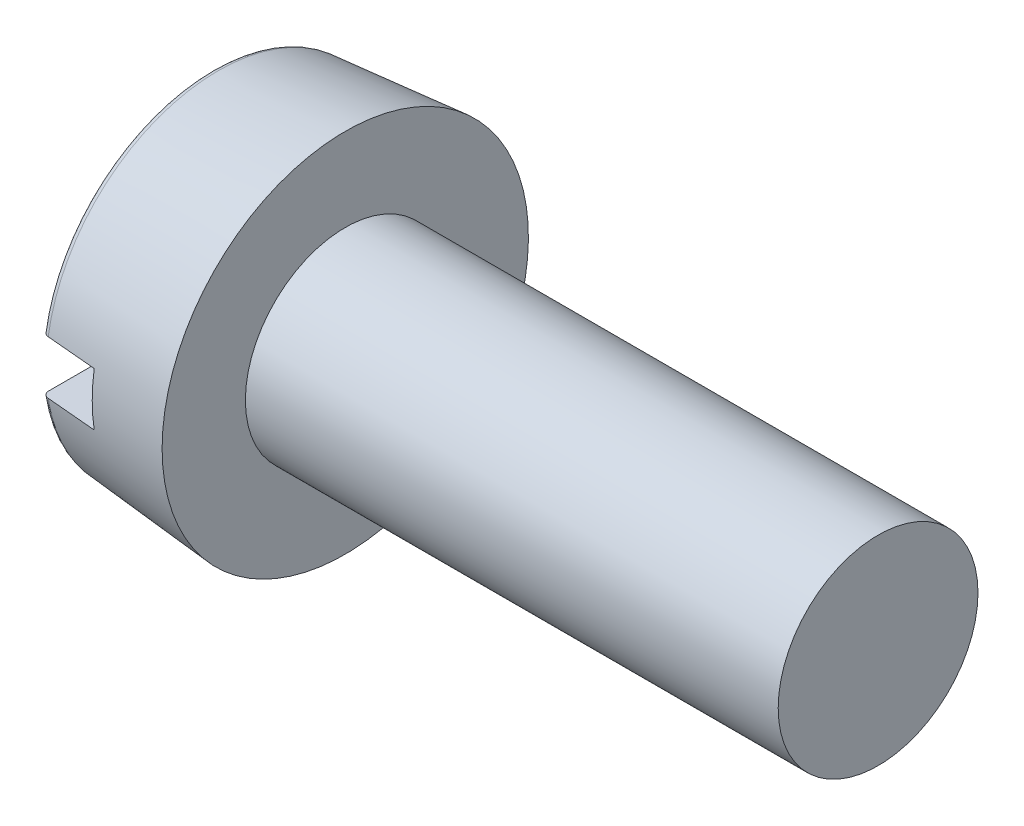
ISO-10303-21;
HEADER;
FILE_DESCRIPTION(('STEP AP214'),'2;1');
FILE_NAME('part.step','',(''),(''),'','','');
FILE_SCHEMA(('AUTOMOTIVE_DESIGN { 1 0 10303 214 1 1 1 1 }'));
ENDSEC;
DATA;
#1=APPLICATION_CONTEXT('core data for automotive mechanical design processes');
#2=APPLICATION_PROTOCOL_DEFINITION('international standard','automotive_design',2000,#1);
#3=PRODUCT_CONTEXT('',#1,'mechanical');
#4=PRODUCT('Part','Part','',(#3));
#5=PRODUCT_RELATED_PRODUCT_CATEGORY('part','',(#4));
#6=PRODUCT_DEFINITION_FORMATION('','',#4);
#7=PRODUCT_DEFINITION_CONTEXT('part definition',#1,'design');
#8=PRODUCT_DEFINITION('design','',#6,#7);
#9=PRODUCT_DEFINITION_SHAPE('','',#8);
#10=(LENGTH_UNIT() NAMED_UNIT(*) SI_UNIT(.MILLI.,.METRE.));
#11=(NAMED_UNIT(*) PLANE_ANGLE_UNIT() SI_UNIT($,.RADIAN.));
#12=(NAMED_UNIT(*) SI_UNIT($,.STERADIAN.) SOLID_ANGLE_UNIT());
#13=UNCERTAINTY_MEASURE_WITH_UNIT(LENGTH_MEASURE(1.E-05),#10,'distance_accuracy_value','');
#14=(GEOMETRIC_REPRESENTATION_CONTEXT(3) GLOBAL_UNCERTAINTY_ASSIGNED_CONTEXT((#13)) GLOBAL_UNIT_ASSIGNED_CONTEXT((#10,
#11,#12)) REPRESENTATION_CONTEXT('',''));
#15=CARTESIAN_POINT('',(0.,0.,0.));
#16=DIRECTION('',(0.,0.,1.));
#17=DIRECTION('',(1.,0.,0.));
#18=AXIS2_PLACEMENT_3D('',#15,#16,#17);
#19=CARTESIAN_POINT('',(0.,0.,0.));
#20=DIRECTION('',(-1.,0.,0.));
#21=DIRECTION('',(0.,0.,1.));
#22=AXIS2_PLACEMENT_3D('',#19,#20,#21);
#23=PLANE('',#22);
#24=DIRECTION('',(0.,0.,-1.));
#25=VECTOR('',#24,1.);
#26=CARTESIAN_POINT('',(0.,0.399999999999999,2.75));
#27=LINE('',#26,#25);
#28=CARTESIAN_POINT('',(0.,0.399999999999999,2.45096382768024));
#29=VERTEX_POINT('',#28);
#30=CARTESIAN_POINT('',(0.,0.399999999999999,-2.45096382768024));
#31=VERTEX_POINT('',#30);
#32=EDGE_CURVE('E93',#29,#31,#27,.T.);
#33=ORIENTED_EDGE('',*,*,#32,.F.);
#34=CARTESIAN_POINT('',(0.,0.,0.));
#35=DIRECTION('',(-1.,0.,0.));
#36=DIRECTION('',(0.,0.,1.));
#37=AXIS2_PLACEMENT_3D('',#34,#35,#36);
#38=CIRCLE('',#37,2.48338955554641);
#39=EDGE_CURVE('E96',#29,#31,#38,.T.);
#40=ORIENTED_EDGE('',*,*,#39,.T.);
#41=EDGE_LOOP('',(#33,#40));
#42=FACE_BOUND('',#41,.T.);
#43=ADVANCED_FACE('F26',(#42),#23,.T.);
#44=CARTESIAN_POINT('',(0.1,0.,0.));
#45=DIRECTION('',(-1.,0.,0.));
#46=DIRECTION('',(0.,0.,1.));
#47=AXIS2_PLACEMENT_3D('',#44,#45,#46);
#48=TOROIDAL_SURFACE('',#47,2.48338955554641,0.1);
#49=CARTESIAN_POINT('',(0.0485751661568925,0.399999999999999,-2.53782400375256));
#50=CARTESIAN_POINT('',(0.053335560648428,0.399999999999999,-2.54071333010714));
#51=CARTESIAN_POINT('',(0.0583417569081208,0.399999999999999,-2.5432050070476));
#52=CARTESIAN_POINT('',(0.0687050566270695,0.399999999999999,-2.54731542775851));
#53=CARTESIAN_POINT('',(0.074062533107433,0.399999999999999,-2.54893322616331));
#54=CARTESIAN_POINT('',(0.0849727450829088,0.399999999999999,-2.55124400653277));
#55=CARTESIAN_POINT('',(0.0905254381371258,0.399999999999999,-2.55193718825242));
#56=CARTESIAN_POINT('',(0.101666850403572,0.399999999999999,-2.55237774737396));
#57=CARTESIAN_POINT('',(0.107255560960916,0.399999999999999,-2.55212534411489));
#58=CARTESIAN_POINT('',(0.118292977477712,0.399999999999999,-2.55068537304434));
#59=CARTESIAN_POINT('',(0.123742072160621,0.399999999999999,-2.54950078182478));
#60=CARTESIAN_POINT('',(0.134364973548136,0.399999999999999,-2.54623584290948));
#61=CARTESIAN_POINT('',(0.139538770226996,0.399999999999999,-2.54415546261614));
#62=CARTESIAN_POINT('',(0.149479719032407,0.399999999999999,-2.53915450094368));
#63=CARTESIAN_POINT('',(0.154245774280699,0.399999999999999,-2.5362317402539));
#64=CARTESIAN_POINT('',(0.16322526708216,0.399999999999999,-2.52963434266422));
#65=CARTESIAN_POINT('',(0.167438683516509,0.399999999999999,-2.52595967704439));
#66=CARTESIAN_POINT('',(0.175235238754912,0.399999999999999,-2.51792797325945));
#67=CARTESIAN_POINT('',(0.178812290222122,0.399999999999999,-2.51356502728085));
#68=CARTESIAN_POINT('',(0.185193520606353,0.399999999999999,-2.50430657366979));
#69=CARTESIAN_POINT('',(0.187997652806075,0.399999999999999,-2.49941103387087));
#70=CARTESIAN_POINT('',(0.192789155673774,0.399999999999999,-2.48916309698215));
#71=CARTESIAN_POINT('',(0.194766254858682,0.399999999999999,-2.48380589705));
#72=CARTESIAN_POINT('',(0.197803265284973,0.399999999999999,-2.47283752208987));
#73=CARTESIAN_POINT('',(0.198863119308796,0.399999999999999,-2.46722633124097));
#74=CARTESIAN_POINT('',(0.200044847417698,0.399999999999999,-2.45584788057293));
#75=CARTESIAN_POINT('',(0.200157020578001,0.399999999999999,-2.45007961163345));
#76=CARTESIAN_POINT('',(0.199415505351017,0.399999999999999,-2.43860536306505));
#77=CARTESIAN_POINT('',(0.198561783586786,0.399999999999999,-2.43289938559553));
#78=CARTESIAN_POINT('',(0.195905910130036,0.399999999999999,-2.42168897882671));
#79=CARTESIAN_POINT('',(0.194100095750389,0.399999999999999,-2.41618541629421));
#80=CARTESIAN_POINT('',(0.189585917001447,0.399999999999999,-2.40556157634262));
#81=CARTESIAN_POINT('',(0.186877563222536,0.399999999999999,-2.40044129442698));
#82=CARTESIAN_POINT('',(0.180646274399763,0.399999999999999,-2.39075689405528));
#83=CARTESIAN_POINT('',(0.177127233156935,0.399999999999999,-2.38619027144736));
#84=CARTESIAN_POINT('',(0.16936410553569,0.399999999999999,-2.37772142685885));
#85=CARTESIAN_POINT('',(0.165120062398032,0.399999999999999,-2.37381916528196));
#86=CARTESIAN_POINT('',(0.15607995674928,0.399999999999999,-2.36683969538108));
#87=CARTESIAN_POINT('',(0.151290949374607,0.399999999999999,-2.36375335061032));
#88=CARTESIAN_POINT('',(0.141257231753731,0.399999999999999,-2.35844131597663));
#89=CARTESIAN_POINT('',(0.136012558112742,0.399999999999999,-2.35621555705808));
#90=CARTESIAN_POINT('',(0.125292467405882,0.399999999999999,-2.35271848818592));
#91=CARTESIAN_POINT('',(0.119821114682516,0.399999999999999,-2.35143471451816));
#92=CARTESIAN_POINT('',(0.10874007026053,0.399999999999999,-2.3498129641862));
#93=CARTESIAN_POINT('',(0.103130386873386,0.399999999999999,-2.34947493083703));
#94=CARTESIAN_POINT('',(0.0919839198921377,0.399999999999999,-2.34975394655982));
#95=CARTESIAN_POINT('',(0.0864469267457421,0.399999999999999,-2.3503627089689));
#96=CARTESIAN_POINT('',(0.0755538584306494,0.399999999999999,-2.35250103603832));
#97=CARTESIAN_POINT('',(0.070197781285211,0.399999999999999,-2.35403059063437));
#98=CARTESIAN_POINT('',(0.0598152881139394,0.399999999999999,-2.35796437216879));
#99=CARTESIAN_POINT('',(0.054788984276408,0.399999999999999,-2.36036889496734));
#100=CARTESIAN_POINT('',(0.0452064655420643,0.399999999999999,-2.36598034847398));
#101=CARTESIAN_POINT('',(0.0406502682628025,0.399999999999999,-2.36918730923854));
#102=CARTESIAN_POINT('',(0.0320917632238232,0.399999999999999,-2.37634229232291));
#103=CARTESIAN_POINT('',(0.028094870668272,0.399999999999999,-2.38029679006583));
#104=CARTESIAN_POINT('',(0.0208109892284708,0.399999999999999,-2.3888128469718));
#105=CARTESIAN_POINT('',(0.0175240500802504,0.399999999999999,-2.39337444862957));
#106=CARTESIAN_POINT('',(0.0117067345908032,0.399999999999999,-2.4030406846898));
#107=CARTESIAN_POINT('',(0.00918709442735062,0.399999999999999,-2.40815178065127));
#108=CARTESIAN_POINT('',(0.00503040363865618,0.399999999999999,-2.41872109198935));
#109=CARTESIAN_POINT('',(0.003393414118762,0.399999999999999,-2.42417933136926));
#110=CARTESIAN_POINT('',(0.00103079629344816,0.399999999999999,-2.4353556964236));
#111=CARTESIAN_POINT('',(0.000315915351137688,0.399999999999999,-2.44107609603135));
#112=CARTESIAN_POINT('',(-0.000148268658822335,0.399999999999999,-2.45255584173235));
#113=CARTESIAN_POINT('',(0.000102427694162917,0.399999999999999,-2.45831518780224));
#114=CARTESIAN_POINT('',(0.00156672863514033,0.399999999999999,-2.46973701475673));
#115=CARTESIAN_POINT('',(0.00278471258006267,0.399999999999999,-2.47539893515676));
#116=CARTESIAN_POINT('',(0.00615802275625762,0.399999999999999,-2.48643816300119));
#117=CARTESIAN_POINT('',(0.00831357182420383,0.399999999999999,-2.49181540244276));
#118=CARTESIAN_POINT('',(0.0134950186698162,0.399999999999999,-2.50210927446436));
#119=CARTESIAN_POINT('',(0.01651790853147,0.399999999999999,-2.50702742235159));
#120=CARTESIAN_POINT('',(0.0233527300396547,0.399999999999999,-2.51627478169689));
#121=CARTESIAN_POINT('',(0.0271636671469914,0.399999999999999,-2.52060472418424));
#122=CARTESIAN_POINT('',(0.0339390198940382,0.399999999999999,-2.52708853011278));
#123=CARTESIAN_POINT('',(0.0367007352855018,0.399999999999999,-2.52945777664795));
#124=CARTESIAN_POINT('',(0.04246511181425,0.399999999999999,-2.5338824942972));
#125=CARTESIAN_POINT('',(0.0454677714717278,0.399999999999999,-2.53593796733816));
#126=CARTESIAN_POINT('',(0.0485751661568925,0.399999999999999,-2.53782400375256));
#127=B_SPLINE_CURVE_WITH_KNOTS('',3,(#49,#50,#51,#52,#53,#54,#55,#56,#57,#58,#59,#60,#61,#62,
#63,#64,#65,#66,#67,#68,#69,#70,#71,#72,#73,#74,#75,#76,#77,#78,#79,#80,#81,#82,#83,#84,#85,#86,
#87,#88,#89,#90,#91,#92,#93,#94,#95,#96,#97,#98,#99,#100,#101,#102,#103,#104,#105,#106,#107,
#108,#109,#110,#111,#112,#113,#114,#115,#116,#117,#118,#119,#120,#121,#122,#123,#124,#125,#126),
.UNSPECIFIED.,.T.,.F.,(4,2,2,2,2,2,2,2,2,2,2,2,2,2,2,2,2,2,2,2,2,2,2,2,2,2,2,2,2,2,2,2,2,2,2,2,
2,2,4),(0.,0.0166927261929599,0.0334034746677627,0.0501106123530613,0.0668138748703243,
0.0834640171570519,0.100114765390758,0.116808983272006,0.133503838928812,0.150350686192216,
0.167198551500755,0.184249859151125,0.201302230381806,0.218528949163409,0.235756263240368,
0.253050339384405,0.270344212607132,0.287556692602934,0.304768146365554,0.321777815466104,
0.338786119383575,0.355565109802712,0.372343094515803,0.388975057176047,0.405606838051781,
0.422244248001944,0.438882281223626,0.455671655511418,0.472462205603378,0.489477908753089,
0.506494789738005,0.523708265225892,0.54092173038536,0.558213576203892,0.575509534125873,
0.592746220451118,0.609961284890882,0.620857694274182,0.631754036740157),.UNSPECIFIED.);
#128=CARTESIAN_POINT('',(0.0912844257247948,0.399999999999999,-2.55184945188353));
#129=VERTEX_POINT('',#128);
#130=EDGE_CURVE('E49',#31,#129,#127,.T.);
#131=ORIENTED_EDGE('',*,*,#130,.F.);
#132=ORIENTED_EDGE('',*,*,#39,.F.);
#133=CARTESIAN_POINT('',(0.066087136792476,0.399999999999999,2.35559521523855));
#134=CARTESIAN_POINT('',(0.0712950927848418,0.399999999999999,2.35369117822232));
#135=CARTESIAN_POINT('',(0.076666857041321,0.399999999999999,2.35222401932616));
#136=CARTESIAN_POINT('',(0.0875846729626109,0.399999999999999,2.35021144655486));
#137=CARTESIAN_POINT('',(0.0931309090012406,0.399999999999999,2.34966704357885));
#138=CARTESIAN_POINT('',(0.104234345782761,0.399999999999999,2.34951890222007));
#139=CARTESIAN_POINT('',(0.109791541651094,0.399999999999999,2.34991481223107));
#140=CARTESIAN_POINT('',(0.120758977338573,0.399999999999999,2.35163438903106));
#141=CARTESIAN_POINT('',(0.126169249425605,0.399999999999999,2.3529578503682));
#142=CARTESIAN_POINT('',(0.136691070159669,0.399999999999999,2.35649136337689));
#143=CARTESIAN_POINT('',(0.141802658139018,0.399999999999999,2.35870129801009));
#144=CARTESIAN_POINT('',(0.151586618009318,0.399999999999999,2.36394124838263));
#145=CARTESIAN_POINT('',(0.15625896099778,0.399999999999999,2.36697131803635));
#146=CARTESIAN_POINT('',(0.165074157354303,0.399999999999999,2.37379047063628));
#147=CARTESIAN_POINT('',(0.169212326798595,0.399999999999999,2.37758560642957));
#148=CARTESIAN_POINT('',(0.176803016968956,0.399999999999999,2.38580863243915));
#149=CARTESIAN_POINT('',(0.180255493017442,0.399999999999999,2.39023656385407));
#150=CARTESIAN_POINT('',(0.186425395678719,0.399999999999999,2.39966205876259));
#151=CARTESIAN_POINT('',(0.189132494897016,0.399999999999999,2.40466638257535));
#152=CARTESIAN_POINT('',(0.19367967078828,0.399999999999999,2.41505452836032));
#153=CARTESIAN_POINT('',(0.195519689004032,0.399999999999999,2.42043837589129));
#154=CARTESIAN_POINT('',(0.19830186658775,0.399999999999999,2.43150243878165));
#155=CARTESIAN_POINT('',(0.199232942923701,0.399999999999999,2.43718544303413));
#156=CARTESIAN_POINT('',(0.200133721631402,0.399999999999999,2.44862724862863));
#157=CARTESIAN_POINT('',(0.200103382520145,0.399999999999999,2.45438605323057));
#158=CARTESIAN_POINT('',(0.199078617330099,0.399999999999999,2.46584997721002));
#159=CARTESIAN_POINT('',(0.198078795088567,0.399999999999999,2.47155461557154));
#160=CARTESIAN_POINT('',(0.195132850395625,0.399999999999999,2.48271426222291));
#161=CARTESIAN_POINT('',(0.193186731461064,0.399999999999999,2.4881692714404));
#162=CARTESIAN_POINT('',(0.188406932533007,0.399999999999999,2.49865615099338));
#163=CARTESIAN_POINT('',(0.185575905837541,0.399999999999999,2.50368922996592));
#164=CARTESIAN_POINT('',(0.179101091115396,0.399999999999999,2.51320240525564));
#165=CARTESIAN_POINT('',(0.175457341207139,0.399999999999999,2.51768252749234));
#166=CARTESIAN_POINT('',(0.167497937800453,0.399999999999999,2.52591455321073));
#167=CARTESIAN_POINT('',(0.16318924419314,0.399999999999999,2.52967318474522));
#168=CARTESIAN_POINT('',(0.15399533800476,0.399999999999999,2.53640297535422));
#169=CARTESIAN_POINT('',(0.149110165043672,0.399999999999999,2.53937418850051));
#170=CARTESIAN_POINT('',(0.138966186483439,0.399999999999999,2.54440671179074));
#171=CARTESIAN_POINT('',(0.133712676926899,0.399999999999999,2.54647869854793));
#172=CARTESIAN_POINT('',(0.122930387636138,0.399999999999999,2.54970170625043));
#173=CARTESIAN_POINT('',(0.117401624409889,0.399999999999999,2.55085278235563));
#174=CARTESIAN_POINT('',(0.106281963774287,0.399999999999999,2.55219206612031));
#175=CARTESIAN_POINT('',(0.100692150468509,0.399999999999999,2.55238928817214));
#176=CARTESIAN_POINT('',(0.0895592860464738,0.399999999999999,2.55183933800322));
#177=CARTESIAN_POINT('',(0.0840162336332734,0.399999999999999,2.55109219206242));
#178=CARTESIAN_POINT('',(0.0731512358601828,0.399999999999999,2.5486799701557));
#179=CARTESIAN_POINT('',(0.0678286781135663,0.399999999999999,2.54701764956405));
#180=CARTESIAN_POINT('',(0.0575363587723267,0.399999999999999,2.54282694850188));
#181=CARTESIAN_POINT('',(0.0525666019474384,0.399999999999999,2.54029855632511));
#182=CARTESIAN_POINT('',(0.0430955298033923,0.399999999999999,2.53443716654266));
#183=CARTESIAN_POINT('',(0.03859644697394,0.399999999999999,2.53110056307376));
#184=CARTESIAN_POINT('',(0.0302151234190859,0.399999999999999,2.52372648341994));
#185=CARTESIAN_POINT('',(0.026332911338312,0.399999999999999,2.51968897470644));
#186=CARTESIAN_POINT('',(0.0192521281963954,0.399999999999999,2.51098384815932));
#187=CARTESIAN_POINT('',(0.0160610119836794,0.399999999999999,2.5063101674796));
#188=CARTESIAN_POINT('',(0.0104977647710904,0.399999999999999,2.49649850826803));
#189=CARTESIAN_POINT('',(0.00812568805622457,0.399999999999999,2.49136049898949));
#190=CARTESIAN_POINT('',(0.00423822124527566,0.399999999999999,2.48069955197134));
#191=CARTESIAN_POINT('',(0.00273352009700192,0.399999999999999,2.4751727157723));
#192=CARTESIAN_POINT('',(0.000664174238575977,0.399999999999999,2.4639457200927));
#193=CARTESIAN_POINT('',(9.95845082644665E-05,0.399999999999999,2.45824555049506));
#194=CARTESIAN_POINT('',(-7.62295306056618E-05,0.399999999999999,2.4467793069312));
#195=CARTESIAN_POINT('',(0.000321125140370979,0.399999999999999,2.44101309976124));
#196=CARTESIAN_POINT('',(0.00207635443678277,0.399999999999999,2.42962883569641));
#197=CARTESIAN_POINT('',(0.00343421550729716,0.399999999999999,2.424010776712));
#198=CARTESIAN_POINT('',(0.00707734815742831,0.399999999999999,2.41307368443565));
#199=CARTESIAN_POINT('',(0.00936409323791634,0.399999999999999,2.40775514160471));
#200=CARTESIAN_POINT('',(0.014804690681413,0.399999999999999,2.39757966614318));
#201=CARTESIAN_POINT('',(0.0179587364122395,0.399999999999999,2.39272283677864));
#202=CARTESIAN_POINT('',(0.0250240732994685,0.399999999999999,2.38364579035037));
#203=CARTESIAN_POINT('',(0.0289303931825737,0.399999999999999,2.37942170099146));
#204=CARTESIAN_POINT('',(0.0374021808573999,0.399999999999999,2.3717039963052));
#205=CARTESIAN_POINT('',(0.0419667955357711,0.399999999999999,2.36820944966134));
#206=CARTESIAN_POINT('',(0.0498248602432996,0.399999999999999,2.3632007701384));
#207=CARTESIAN_POINT('',(0.0529598990957766,0.399999999999999,2.36143340044221));
#208=CARTESIAN_POINT('',(0.0594027181877445,0.399999999999999,2.35824787663633));
#209=CARTESIAN_POINT('',(0.062710497205202,0.399999999999999,2.35682972005658));
#210=CARTESIAN_POINT('',(0.066087136792476,0.399999999999999,2.35559521523855));
#211=B_SPLINE_CURVE_WITH_KNOTS('',3,(#133,#134,#135,#136,#137,#138,#139,#140,#141,#142,#143,
#144,#145,#146,#147,#148,#149,#150,#151,#152,#153,#154,#155,#156,#157,#158,#159,#160,#161,#162,
#163,#164,#165,#166,#167,#168,#169,#170,#171,#172,#173,#174,#175,#176,#177,#178,#179,#180,#181,
#182,#183,#184,#185,#186,#187,#188,#189,#190,#191,#192,#193,#194,#195,#196,#197,#198,#199,#200,
#201,#202,#203,#204,#205,#206,#207,#208,#209,#210),.UNSPECIFIED.,.T.,.F.,(4,2,2,2,2,2,2,2,2,2,2,
2,2,2,2,2,2,2,2,2,2,2,2,2,2,2,2,2,2,2,2,2,2,2,2,2,2,2,4),(0.,0.0166222541478177,
0.0332627065942929,0.0498969377445997,0.0665274855903878,0.0831558384784712,0.0997852847538594,
0.116551858795266,0.133319524934732,0.150308994702433,0.16729960970923,0.184494901354411,
0.201690934940426,0.218983234681923,0.236275470158237,0.253516346249615,0.270756413877768,
0.287826942378045,0.304896298346318,0.321757040586668,0.338616772841758,0.355316856730833,
0.372016475898998,0.388666089268513,0.405315927691637,0.422041464353441,0.438767777445074,
0.455666404024134,0.472566150410065,0.489669935249993,0.506774720322791,0.524032613353522,
0.541290262841154,0.558575395944134,0.575864385959096,0.593042819367108,0.610199187265656,
0.620976497689188,0.631753731880016),.UNSPECIFIED.);
#212=CARTESIAN_POINT('',(0.0912844257242457,0.399999999999999,2.55184945188577));
#213=VERTEX_POINT('',#212);
#214=EDGE_CURVE('E85',#213,#29,#211,.T.);
#215=ORIENTED_EDGE('',*,*,#214,.F.);
#216=CARTESIAN_POINT('',(0.0912844257252333,0.,0.));
#217=DIRECTION('',(-1.,0.,0.));
#218=DIRECTION('',(0.,0.,1.));
#219=AXIS2_PLACEMENT_3D('',#216,#217,#218);
#220=CIRCLE('',#219,2.58300902535558);
#221=EDGE_CURVE('E100',#129,#213,#220,.F.);
#222=ORIENTED_EDGE('',*,*,#221,.F.);
#223=EDGE_LOOP('',(#131,#132,#215,#222));
#224=FACE_BOUND('',#223,.T.);
#225=ADVANCED_FACE('F172',(#224),#48,.T.);
#226=CARTESIAN_POINT('',(-25.4,0.,0.));
#227=DIRECTION('',(-1.,0.,0.));
#228=DIRECTION('',(0.,0.,1.));
#229=AXIS2_PLACEMENT_3D('',#226,#227,#228);
#230=CYLINDRICAL_SURFACE('',#229,1.5);
#231=CARTESIAN_POINT('',(10.,0.,0.));
#232=DIRECTION('',(-1.,0.,0.));
#233=DIRECTION('',(0.,0.,1.));
#234=AXIS2_PLACEMENT_3D('',#231,#232,#233);
#235=CIRCLE('',#234,1.5);
#236=CARTESIAN_POINT('',(10.,0.,1.5));
#237=VERTEX_POINT('',#236);
#238=EDGE_CURVE('E97',#237,#237,#235,.T.);
#239=ORIENTED_EDGE('',*,*,#238,.T.);
#240=EDGE_LOOP('',(#239));
#241=FACE_BOUND('',#240,.T.);
#242=CARTESIAN_POINT('',(2.,0.,0.));
#243=DIRECTION('',(-1.,0.,0.));
#244=DIRECTION('',(0.,0.,1.));
#245=AXIS2_PLACEMENT_3D('',#242,#243,#244);
#246=CIRCLE('',#245,1.5);
#247=CARTESIAN_POINT('',(2.,0.,1.5));
#248=VERTEX_POINT('',#247);
#249=EDGE_CURVE('E160',#248,#248,#246,.T.);
#250=ORIENTED_EDGE('',*,*,#249,.F.);
#251=EDGE_LOOP('',(#250));
#252=FACE_BOUND('',#251,.T.);
#253=ADVANCED_FACE('F28',(#241,#252),#230,.T.);
#254=CARTESIAN_POINT('',(10.,1.5,0.));
#255=DIRECTION('',(1.,0.,0.));
#256=DIRECTION('',(0.,0.,-1.));
#257=AXIS2_PLACEMENT_3D('',#254,#255,#256);
#258=PLANE('',#257);
#259=ORIENTED_EDGE('',*,*,#238,.F.);
#260=EDGE_LOOP('',(#259));
#261=FACE_BOUND('',#260,.T.);
#262=ADVANCED_FACE('F171',(#261),#258,.T.);
#263=DIRECTION('',(0.,0.,1.));
#264=VECTOR('',#263,1.);
#265=CARTESIAN_POINT('',(0.,-0.4,-2.75));
#266=LINE('',#265,#264);
#267=CARTESIAN_POINT('',(0.,-0.4,-2.45096382768024));
#268=VERTEX_POINT('',#267);
#269=CARTESIAN_POINT('',(0.,-0.4,2.45096382768024));
#270=VERTEX_POINT('',#269);
#271=EDGE_CURVE('E41',#268,#270,#266,.T.);
#272=ORIENTED_EDGE('',*,*,#271,.F.);
#273=EDGE_CURVE('E91',#268,#270,#38,.T.);
#274=ORIENTED_EDGE('',*,*,#273,.T.);
#275=EDGE_LOOP('',(#272,#274));
#276=FACE_BOUND('',#275,.T.);
#277=ADVANCED_FACE('F90',(#276),#23,.T.);
#278=CARTESIAN_POINT('',(0.,0.,0.));
#279=DIRECTION('',(1.,0.,0.));
#280=DIRECTION('',(0.,0.,-1.));
#281=AXIS2_PLACEMENT_3D('',#278,#279,#280);
#282=CONICAL_SURFACE('',#281,2.57502267294815,0.0872664625997164);
#283=CARTESIAN_POINT('',(5.21123588736544,0.399999999999999,3.00443640584799));
#284=CARTESIAN_POINT('',(4.41342358696222,0.399999999999999,2.93401988873196));
#285=CARTESIAN_POINT('',(3.61561486907634,0.399999999999999,2.86356274948076));
#286=CARTESIAN_POINT('',(2.0200069246513,0.399999999999999,2.72254136292326));
#287=CARTESIAN_POINT('',(1.22220769811185,0.399999999999999,2.65197711562021));
#288=CARTESIAN_POINT('',(-0.373378996688641,0.399999999999999,2.51071564393346));
#289=CARTESIAN_POINT('',(-1.17116646494953,0.399999999999999,2.44001841954794));
#290=CARTESIAN_POINT('',(-2.76672581923324,0.399999999999999,2.298448092182));
#291=CARTESIAN_POINT('',(-3.56449770525557,0.399999999999999,2.22757498919618));
#292=CARTESIAN_POINT('',(-4.36225986914578,0.399999999999999,2.15659249784001));
#293=B_SPLINE_CURVE_WITH_KNOTS('',3,(#283,#284,#285,#286,#287,#288,#289,#290,#291,#292),
.UNSPECIFIED.,.F.,.F.,(4,2,2,2,4),(0.,2.40274147318214,4.80548287330205,7.20822430613117,
9.6109658126378),.UNSPECIFIED.);
#294=CARTESIAN_POINT('',(0.85,0.399999999999999,2.61901832187334));
#295=VERTEX_POINT('',#294);
#296=EDGE_CURVE('E151',#295,#213,#293,.T.);
#297=ORIENTED_EDGE('',*,*,#296,.F.);
#298=CARTESIAN_POINT('',(0.85,0.,0.));
#299=DIRECTION('',(1.,0.,0.));
#300=DIRECTION('',(0.,0.,-1.));
#301=AXIS2_PLACEMENT_3D('',#298,#299,#300);
#302=CIRCLE('',#301,2.64938803694519);
#303=CARTESIAN_POINT('',(0.85,-0.4,2.61901832187334));
#304=VERTEX_POINT('',#303);
#305=EDGE_CURVE('E11',#304,#295,#302,.F.);
#306=ORIENTED_EDGE('',*,*,#305,.F.);
#307=CARTESIAN_POINT('',(-4.36225986914578,-0.4,2.15659249784001));
#308=CARTESIAN_POINT('',(-3.0225287932993,-0.4,2.27578971400985));
#309=CARTESIAN_POINT('',(-1.68277158070832,-0.4,2.3946924855258));
#310=CARTESIAN_POINT('',(-0.087192971572953,-0.4,2.5360455579839));
#311=CARTESIAN_POINT('',(0.168610376643268,-0.4,2.55869953286896));
#312=CARTESIAN_POINT('',(2.02000114161503,-0.4,2.72260692865391));
#313=CARTESIAN_POINT('',(3.61561248830953,-0.4,2.86359016848939));
#314=CARTESIAN_POINT('',(5.21123588736544,-0.4,3.00443640584799));
#315=B_SPLINE_CURVE_WITH_KNOTS('',3,(#307,#308,#309,#310,#311,#312,#313,#314),.UNSPECIFIED.,.F.,
.F.,(4,2,2,4),(0.,4.03506939923899,4.80548292410975,9.61096578658458),.UNSPECIFIED.);
#316=CARTESIAN_POINT('',(0.0912844257252334,-0.4,2.5518494518816));
#317=VERTEX_POINT('',#316);
#318=EDGE_CURVE('E129',#317,#304,#315,.T.);
#319=ORIENTED_EDGE('',*,*,#318,.F.);
#320=CARTESIAN_POINT('',(0.0912844257252334,-0.4,-2.55184945188164));
#321=VERTEX_POINT('',#320);
#322=EDGE_CURVE('E106',#317,#321,#220,.F.);
#323=ORIENTED_EDGE('',*,*,#322,.T.);
#324=CARTESIAN_POINT('',(5.21123588736544,-0.4,-3.00443640584799));
#325=CARTESIAN_POINT('',(4.41342358696222,-0.4,-2.93401988873196));
#326=CARTESIAN_POINT('',(3.61561486907634,-0.4,-2.86356274948076));
#327=CARTESIAN_POINT('',(2.0200069246513,-0.4,-2.72254136292326));
#328=CARTESIAN_POINT('',(1.22220769811185,-0.4,-2.65197711562021));
#329=CARTESIAN_POINT('',(-0.373378996688641,-0.4,-2.51071564393346));
#330=CARTESIAN_POINT('',(-1.17116646494953,-0.4,-2.44001841954794));
#331=CARTESIAN_POINT('',(-2.76672581923324,-0.4,-2.298448092182));
#332=CARTESIAN_POINT('',(-3.56449770525557,-0.4,-2.22757498919618));
#333=CARTESIAN_POINT('',(-4.36225986914578,-0.4,-2.15659249784001));
#334=B_SPLINE_CURVE_WITH_KNOTS('',3,(#324,#325,#326,#327,#328,#329,#330,#331,#332,#333),
.UNSPECIFIED.,.F.,.F.,(4,2,2,2,4),(0.,2.40274147318214,4.80548287330205,7.20822430613117,
9.6109658126378),.UNSPECIFIED.);
#335=CARTESIAN_POINT('',(0.85,-0.4,-2.61901832187334));
#336=VERTEX_POINT('',#335);
#337=EDGE_CURVE('E80',#336,#321,#334,.T.);
#338=ORIENTED_EDGE('',*,*,#337,.F.);
#339=CARTESIAN_POINT('',(0.85,0.399999999999999,-2.61901832187334));
#340=VERTEX_POINT('',#339);
#341=EDGE_CURVE('E30',#340,#336,#302,.F.);
#342=ORIENTED_EDGE('',*,*,#341,.F.);
#343=CARTESIAN_POINT('',(-4.36225986914578,0.399999999999999,-2.15659249784001));
#344=CARTESIAN_POINT('',(-3.0225287932993,0.399999999999999,-2.27578971400985));
#345=CARTESIAN_POINT('',(-1.68277158070832,0.399999999999999,-2.3946924855258));
#346=CARTESIAN_POINT('',(-0.087192971572953,0.399999999999999,-2.5360455579839));
#347=CARTESIAN_POINT('',(0.168610376643268,0.399999999999999,-2.55869953286896));
#348=CARTESIAN_POINT('',(2.02000114161503,0.399999999999999,-2.72260692865391));
#349=CARTESIAN_POINT('',(3.61561248830953,0.399999999999999,-2.86359016848939));
#350=CARTESIAN_POINT('',(5.21123588736544,0.399999999999999,-3.00443640584799));
#351=B_SPLINE_CURVE_WITH_KNOTS('',3,(#343,#344,#345,#346,#347,#348,#349,#350),.UNSPECIFIED.,.F.,
.F.,(4,2,2,4),(0.,4.03506939923899,4.80548292410975,9.61096578658458),.UNSPECIFIED.);
#352=EDGE_CURVE('E155',#129,#340,#351,.T.);
#353=ORIENTED_EDGE('',*,*,#352,.F.);
#354=ORIENTED_EDGE('',*,*,#221,.T.);
#355=EDGE_LOOP('',(#297,#306,#319,#323,#338,#342,#353,#354));
#356=FACE_BOUND('',#355,.T.);
#357=CARTESIAN_POINT('',(2.,0.,0.));
#358=DIRECTION('',(-1.,0.,0.));
#359=DIRECTION('',(0.,0.,1.));
#360=AXIS2_PLACEMENT_3D('',#357,#358,#359);
#361=CIRCLE('',#360,2.75);
#362=CARTESIAN_POINT('',(2.,0.,2.75));
#363=VERTEX_POINT('',#362);
#364=EDGE_CURVE('E102',#363,#363,#361,.T.);
#365=ORIENTED_EDGE('',*,*,#364,.T.);
#366=EDGE_LOOP('',(#365));
#367=FACE_BOUND('',#366,.T.);
#368=ADVANCED_FACE('F141',(#356,#367),#282,.T.);
#369=CARTESIAN_POINT('',(2.,1.5,0.));
#370=DIRECTION('',(-1.,0.,0.));
#371=DIRECTION('',(0.,0.,1.));
#372=AXIS2_PLACEMENT_3D('',#369,#370,#371);
#373=PLANE('',#372);
#374=ORIENTED_EDGE('',*,*,#364,.F.);
#375=EDGE_LOOP('',(#374));
#376=FACE_BOUND('',#375,.T.);
#377=ORIENTED_EDGE('',*,*,#249,.T.);
#378=EDGE_LOOP('',(#377));
#379=FACE_BOUND('',#378,.T.);
#380=ADVANCED_FACE('F145',(#376,#379),#373,.F.);
#381=CARTESIAN_POINT('',(0.0485751661568924,-0.4,-2.53782400375256));
#382=CARTESIAN_POINT('',(0.043742700889073,-0.4,-2.53489033603248));
#383=CARTESIAN_POINT('',(0.0391565039520058,-0.4,-2.53154249233901));
#384=CARTESIAN_POINT('',(0.0306096912349645,-0.4,-2.52411912703245));
#385=CARTESIAN_POINT('',(0.0266499199134283,-0.4,-2.52004263865816));
#386=CARTESIAN_POINT('',(0.0194724144414637,-0.4,-2.51128827187889));
#387=CARTESIAN_POINT('',(0.0162539430758686,-0.4,-2.5066109982245));
#388=CARTESIAN_POINT('',(0.0106407914468132,-0.4,-2.49678789814068));
#389=CARTESIAN_POINT('',(0.00824590952942974,-0.4,-2.4916421867979));
#390=CARTESIAN_POINT('',(0.00432284245737381,-0.4,-2.48097764448566));
#391=CARTESIAN_POINT('',(0.00280265847762437,-0.4,-2.47545587010949));
#392=CARTESIAN_POINT('',(0.000701595208248543,-0.4,-2.46423612609241));
#393=CARTESIAN_POINT('',(0.000120808101596112,-0.4,-2.45853813921568));
#394=CARTESIAN_POINT('',(-8.77639340342732E-05,-0.4,-2.44707338759541));
#395=CARTESIAN_POINT('',(0.000293055254025186,-0.4,-2.44130646469098));
#396=CARTESIAN_POINT('',(0.00201549855238157,-0.4,-2.42991778305268));
#397=CARTESIAN_POINT('',(0.00335714465243868,-0.4,-2.42429602764421));
#398=CARTESIAN_POINT('',(0.00696895281533291,-0.4,-2.41334782418293));
#399=CARTESIAN_POINT('',(0.0092407561566746,-0.4,-2.40802191712191));
#400=CARTESIAN_POINT('',(0.0146521431767619,-0.4,-2.39783066596844));
#401=CARTESIAN_POINT('',(0.0177917032773429,-0.4,-2.39296530936701));
#402=CARTESIAN_POINT('',(0.0248287411053429,-0.4,-2.38387042526437));
#403=CARTESIAN_POINT('',(0.0287209141925619,-0.4,-2.37963679509589));
#404=CARTESIAN_POINT('',(0.0371689847043463,-0.4,-2.37189344325919));
#405=CARTESIAN_POINT('',(0.0417248374973375,-0.4,-2.36838367295066));
#406=CARTESIAN_POINT('',(0.0513088940529644,-0.4,-2.36223607999804));
#407=CARTESIAN_POINT('',(0.0563303170031117,-0.4,-2.35958768701902));
#408=CARTESIAN_POINT('',(0.0667506637390622,-0.4,-2.35518417776549));
#409=CARTESIAN_POINT('',(0.0721495575296707,-0.4,-2.35342899060518));
#410=CARTESIAN_POINT('',(0.0830969218561982,-0.4,-2.35088371920364));
#411=CARTESIAN_POINT('',(0.0886425771214799,-0.4,-2.35008151768943));
#412=CARTESIAN_POINT('',(0.0997895698319816,-0.4,-2.34942645825663));
#413=CARTESIAN_POINT('',(0.105390904537026,-0.4,-2.34957355384856));
#414=CARTESIAN_POINT('',(0.11645098948353,-0.4,-2.35080823875911));
#415=CARTESIAN_POINT('',(0.121910439899224,-0.4,-2.35188957154329));
#416=CARTESIAN_POINT('',(0.132571054932581,-0.4,-2.35495102017176));
#417=CARTESIAN_POINT('',(0.137772218979376,-0.4,-2.35693113800247));
#418=CARTESIAN_POINT('',(0.147785607499862,-0.4,-2.36173694974296));
#419=CARTESIAN_POINT('',(0.152596707655125,-0.4,-2.36456498478211));
#420=CARTESIAN_POINT('',(0.161682450459402,-0.4,-2.37098051347151));
#421=CARTESIAN_POINT('',(0.165957067006595,-0.4,-2.3745680440511));
#422=CARTESIAN_POINT('',(0.173898476720826,-0.4,-2.38244089229649));
#423=CARTESIAN_POINT('',(0.177558250715632,-0.4,-2.38673328868116));
#424=CARTESIAN_POINT('',(0.184116745306164,-0.4,-2.39586460061934));
#425=CARTESIAN_POINT('',(0.187015411909098,-0.4,-2.40070355491074));
#426=CARTESIAN_POINT('',(0.1920102965789,-0.4,-2.41086084949244));
#427=CARTESIAN_POINT('',(0.194095133740737,-0.4,-2.41618478733958));
#428=CARTESIAN_POINT('',(0.197351618314204,-0.4,-2.42710502099882));
#429=CARTESIAN_POINT('',(0.198523208401552,-0.4,-2.43270133388441));
#430=CARTESIAN_POINT('',(0.199929764454566,-0.4,-2.44406834904126));
#431=CARTESIAN_POINT('',(0.200155100074746,-0.4,-2.44984024500279));
#432=CARTESIAN_POINT('',(0.199636288045938,-0.4,-2.4613404318168));
#433=CARTESIAN_POINT('',(0.198892115679426,-0.4,-2.46706872155379));
#434=CARTESIAN_POINT('',(0.196450104345965,-0.4,-2.47833342633219));
#435=CARTESIAN_POINT('',(0.19474990339858,-0.4,-2.48386932995355));
#436=CARTESIAN_POINT('',(0.190438851147456,-0.4,-2.49457461930592));
#437=CARTESIAN_POINT('',(0.18782801704074,-0.4,-2.49974401195617));
#438=CARTESIAN_POINT('',(0.181784168210251,-0.4,-2.50953562475824));
#439=CARTESIAN_POINT('',(0.178356081275477,-0.4,-2.51416088532287));
#440=CARTESIAN_POINT('',(0.170763854311404,-0.4,-2.52276187931021));
#441=CARTESIAN_POINT('',(0.166599755887441,-0.4,-2.52673764942296));
#442=CARTESIAN_POINT('',(0.157703749960624,-0.4,-2.53387831326103));
#443=CARTESIAN_POINT('',(0.152978790793141,-0.4,-2.53705186263633));
#444=CARTESIAN_POINT('',(0.143058302597856,-0.4,-2.54254944807672));
#445=CARTESIAN_POINT('',(0.137862824904437,-0.4,-2.54487357667608));
#446=CARTESIAN_POINT('',(0.127215096181337,-0.4,-2.54857855240269));
#447=CARTESIAN_POINT('',(0.121766627201615,-0.4,-2.54997027378005));
#448=CARTESIAN_POINT('',(0.110711267088449,-0.4,-2.55181190787766));
#449=CARTESIAN_POINT('',(0.105104343718791,-0.4,-2.55226162753717));
#450=CARTESIAN_POINT('',(0.093934771500752,-0.4,-2.552205294953));
#451=CARTESIAN_POINT('',(0.0883720843451993,-0.4,-2.55170582304087));
#452=CARTESIAN_POINT('',(0.0774146742968078,-0.4,-2.54977933214903));
#453=CARTESIAN_POINT('',(0.0720197510015749,-0.4,-2.54835346819235));
#454=CARTESIAN_POINT('',(0.0636134861796509,-0.4,-2.54535751471385));
#455=CARTESIAN_POINT('',(0.0605001894166271,-0.4,-2.54406538475537));
#456=CARTESIAN_POINT('',(0.0544205154682464,-0.4,-2.54117250369181));
#457=CARTESIAN_POINT('',(0.0514541373617044,-0.4,-2.53957175452209));
#458=CARTESIAN_POINT('',(0.0485751661568924,-0.4,-2.53782400375256));
#459=B_SPLINE_CURVE_WITH_KNOTS('',3,(#381,#382,#383,#384,#385,#386,#387,#388,#389,#390,#391,
#392,#393,#394,#395,#396,#397,#398,#399,#400,#401,#402,#403,#404,#405,#406,#407,#408,#409,#410,
#411,#412,#413,#414,#415,#416,#417,#418,#419,#420,#421,#422,#423,#424,#425,#426,#427,#428,#429,
#430,#431,#432,#433,#434,#435,#436,#437,#438,#439,#440,#441,#442,#443,#444,#445,#446,#447,#448,
#449,#450,#451,#452,#453,#454,#455,#456,#457,#458),.UNSPECIFIED.,.T.,.F.,(4,2,2,2,2,2,2,2,2,2,2,
2,2,2,2,2,2,2,2,2,2,2,2,2,2,2,2,2,2,2,2,2,2,2,2,2,2,2,4),(0.,0.016947240732267,0.03391713616015,
0.0508700816238964,0.0678188732388516,0.0849203328631082,0.102023470551057,0.119280182389639,
0.136537289182897,0.153824978576453,0.171112198285483,0.188281743401668,0.205450134421422,
0.222399111451824,0.239346743182753,0.256076496133358,0.272805429792138,0.289423191548409,
0.306040990031791,0.322705100111853,0.339370020645595,0.356213876748639,0.373058927428501,
0.390131760531073,0.407205665204685,0.424452921752968,0.441700618027207,0.458991115172603,
0.476281285810014,0.493469727421072,0.510657197712653,0.527650439747464,0.544641830018657,
0.561431437560975,0.578224485752214,0.594901539591071,0.611557840324385,0.621654327588065,
0.631750751538409),.UNSPECIFIED.);
#460=EDGE_CURVE('E76',#321,#268,#459,.T.);
#461=ORIENTED_EDGE('',*,*,#460,.F.);
#462=ORIENTED_EDGE('',*,*,#322,.F.);
#463=CARTESIAN_POINT('',(0.066087136792476,-0.4,2.35559521523855));
#464=CARTESIAN_POINT('',(0.0608105945502048,-0.4,2.35752487852842));
#465=CARTESIAN_POINT('',(0.0556944752428517,-0.4,2.3599059129028));
#466=CARTESIAN_POINT('',(0.0459323966354493,-0.4,2.36549830449194));
#467=CARTESIAN_POINT('',(0.041287068719781,-0.4,2.36871075675094));
#468=CARTESIAN_POINT('',(0.032604379070266,-0.4,2.37586468923515));
#469=CARTESIAN_POINT('',(0.0285663918791529,-0.4,2.37980541001391));
#470=CARTESIAN_POINT('',(0.0212026684834657,-0.4,2.38830165313251));
#471=CARTESIAN_POINT('',(0.0178767642753714,-0.4,2.39285703004061));
#472=CARTESIAN_POINT('',(0.0119934549886913,-0.4,2.4025019984765));
#473=CARTESIAN_POINT('',(0.00944402228749046,-0.4,2.40759645260631));
#474=CARTESIAN_POINT('',(0.00522519796804258,-0.4,2.41813782358851));
#475=CARTESIAN_POINT('',(0.00355590002102171,-0.4,2.42358477788764));
#476=CARTESIAN_POINT('',(0.00112661898390325,-0.4,2.43474435525461));
#477=CARTESIAN_POINT('',(0.000377433998971239,-0.4,2.44045933087073));
#478=CARTESIAN_POINT('',(-0.000155971609908974,-0.4,2.45193424749558));
#479=CARTESIAN_POINT('',(5.98437539214584E-05,-0.4,2.45769419017327));
#480=CARTESIAN_POINT('',(0.00145482264639189,-0.4,2.4691245835607));
#481=CARTESIAN_POINT('',(0.00263861487831221,-0.4,2.47479447055272));
#482=CARTESIAN_POINT('',(0.00594479382623159,-0.4,2.48585382181204));
#483=CARTESIAN_POINT('',(0.0080671709482321,-0.4,2.4912432889451));
#484=CARTESIAN_POINT('',(0.0131842826089136,-0.4,2.50156580381608));
#485=CARTESIAN_POINT('',(0.0161757093406995,-0.4,2.50650049043758));
#486=CARTESIAN_POINT('',(0.0229526816297058,-0.4,2.51579078048696));
#487=CARTESIAN_POINT('',(0.0267381882112737,-0.4,2.52014641231933));
#488=CARTESIAN_POINT('',(0.0349549522819582,-0.4,2.52810621279062));
#489=CARTESIAN_POINT('',(0.0393791679507018,-0.4,2.53171764933511));
#490=CARTESIAN_POINT('',(0.0487773745070072,-0.4,2.53813557351638));
#491=CARTESIAN_POINT('',(0.0537513271234718,-0.4,2.54094211713863));
#492=CARTESIAN_POINT('',(0.0640426596902495,-0.4,2.54563498979798));
#493=CARTESIAN_POINT('',(0.0693551226039386,-0.4,2.5475321037118));
#494=CARTESIAN_POINT('',(0.0802247129351556,-0.4,2.55039839200113));
#495=CARTESIAN_POINT('',(0.0857818262597894,-0.4,2.55136761975382));
#496=CARTESIAN_POINT('',(0.0969295068477404,-0.4,2.55234385612009));
#497=CARTESIAN_POINT('',(0.102519326325114,-0.4,2.55235942192522));
#498=CARTESIAN_POINT('',(0.113621717842258,-0.4,2.55144947170831));
#499=CARTESIAN_POINT('',(0.119134291728872,-0.4,2.55052397822485));
#500=CARTESIAN_POINT('',(0.12991315715357,-0.4,2.54776325488686));
#501=CARTESIAN_POINT('',(0.135179979695444,-0.4,2.54593009634288));
#502=CARTESIAN_POINT('',(0.14533338195721,-0.4,2.54141002564133));
#503=CARTESIAN_POINT('',(0.150219955236063,-0.4,2.53872309902571));
#504=CARTESIAN_POINT('',(0.159502666916409,-0.4,2.5325586246071));
#505=CARTESIAN_POINT('',(0.163896113948941,-0.4,2.52907702558495));
#506=CARTESIAN_POINT('',(0.172043834916818,-0.4,2.52143276158102));
#507=CARTESIAN_POINT('',(0.175798076961159,-0.4,2.51727006263833));
#508=CARTESIAN_POINT('',(0.182604163786229,-0.4,2.50833478591539));
#509=CARTESIAN_POINT('',(0.185648086206779,-0.4,2.50355617440357));
#510=CARTESIAN_POINT('',(0.19090152145622,-0.4,2.49356047830666));
#511=CARTESIAN_POINT('',(0.193110979885753,-0.4,2.4883433651624));
#512=CARTESIAN_POINT('',(0.196659930990868,-0.4,2.47755170451601));
#513=CARTESIAN_POINT('',(0.197988676101266,-0.4,2.47197362162933));
#514=CARTESIAN_POINT('',(0.199699497616489,-0.4,2.46067407504842));
#515=CARTESIAN_POINT('',(0.20008152317449,-0.4,2.45495260366968));
#516=CARTESIAN_POINT('',(0.199888693786855,-0.4,2.44347761139864));
#517=CARTESIAN_POINT('',(0.199305786466706,-0.4,2.43772422417512));
#518=CARTESIAN_POINT('',(0.197183396962278,-0.4,2.42639649613519));
#519=CARTESIAN_POINT('',(0.195643893907937,-0.4,2.42082215922791));
#520=CARTESIAN_POINT('',(0.191647358782498,-0.4,2.41000689513081));
#521=CARTESIAN_POINT('',(0.189189525029139,-0.4,2.40476626395098));
#522=CARTESIAN_POINT('',(0.183422446278924,-0.4,2.39477626653133));
#523=CARTESIAN_POINT('',(0.180113225729292,-0.4,2.39002688619092));
#524=CARTESIAN_POINT('',(0.172762307166356,-0.4,2.38119455975028));
#525=CARTESIAN_POINT('',(0.168726370035366,-0.4,2.37710682086271));
#526=CARTESIAN_POINT('',(0.160017645288822,-0.4,2.36967805871209));
#527=CARTESIAN_POINT('',(0.155344928487097,-0.4,2.36633695252778));
#528=CARTESIAN_POINT('',(0.145561135599925,-0.4,2.36054338093363));
#529=CARTESIAN_POINT('',(0.140456663489582,-0.4,2.35807976269219));
#530=CARTESIAN_POINT('',(0.129901516966528,-0.4,2.35405629153212));
#531=CARTESIAN_POINT('',(0.124450780981881,-0.4,2.35249659984984));
#532=CARTESIAN_POINT('',(0.113430211306763,-0.4,2.35034396470641));
#533=CARTESIAN_POINT('',(0.107862588812257,-0.4,2.34973965558371));
#534=CARTESIAN_POINT('',(0.0967101969668429,-0.4,2.34948171969541));
#535=CARTESIAN_POINT('',(0.091125458824731,-0.4,2.34982687285342));
#536=CARTESIAN_POINT('',(0.0822854426850392,-0.4,2.35112999215385));
#537=CARTESIAN_POINT('',(0.0789835903303949,-0.4,2.35179110990866));
#538=CARTESIAN_POINT('',(0.072464361176774,-0.4,2.35344593540385));
#539=CARTESIAN_POINT('',(0.0692469836329172,-0.4,2.3544396402105));
#540=CARTESIAN_POINT('',(0.066087136792476,-0.4,2.35559521523855));
#541=B_SPLINE_CURVE_WITH_KNOTS('',3,(#463,#464,#465,#466,#467,#468,#469,#470,#471,#472,#473,
#474,#475,#476,#477,#478,#479,#480,#481,#482,#483,#484,#485,#486,#487,#488,#489,#490,#491,#492,
#493,#494,#495,#496,#497,#498,#499,#500,#501,#502,#503,#504,#505,#506,#507,#508,#509,#510,#511,
#512,#513,#514,#515,#516,#517,#518,#519,#520,#521,#522,#523,#524,#525,#526,#527,#528,#529,#530,
#531,#532,#533,#534,#535,#536,#537,#538,#539,#540),.UNSPECIFIED.,.T.,.F.,(4,2,2,2,2,2,2,2,2,2,2,
2,2,2,2,2,2,2,2,2,2,2,2,2,2,2,2,2,2,2,2,2,2,2,2,2,2,2,4),(0.,0.0168424750743688,
0.0337072469428218,0.0505545302746078,0.0673978343938477,0.0844086595317174,0.101421294737152,
0.118631732868636,0.13584281283471,0.153136677947412,0.170430366290294,0.187659074407731,
0.204886937089933,0.221937615090733,0.238987106819418,0.255829075426629,0.272670075131689,
0.289359938509869,0.306049402171548,0.322700954454501,0.33935278873664,0.35609148862303,
0.372831023386549,0.389749176795124,0.406668432921035,0.423790533399583,0.440913553459407,
0.458180186872609,0.475447197005396,0.492729316207192,0.510010939215389,0.527161157578304,
0.54430947028508,0.561231319691048,0.578156186574315,0.594878150313084,0.611578636064082,
0.62166480777393,0.631750890516262),.UNSPECIFIED.);
#542=EDGE_CURVE('E86',#270,#317,#541,.T.);
#543=ORIENTED_EDGE('',*,*,#542,.F.);
#544=ORIENTED_EDGE('',*,*,#273,.F.);
#545=EDGE_LOOP('',(#461,#462,#543,#544));
#546=FACE_BOUND('',#545,.T.);
#547=ADVANCED_FACE('F95',(#546),#48,.T.);
#548=CARTESIAN_POINT('',(0.85,0.399999999999999,2.75));
#549=DIRECTION('',(0.,1.,0.));
#550=DIRECTION('',(0.,0.,1.));
#551=AXIS2_PLACEMENT_3D('',#548,#549,#550);
#552=PLANE('',#551);
#553=ORIENTED_EDGE('',*,*,#352,.T.);
#554=DIRECTION('',(0.,0.,-1.));
#555=VECTOR('',#554,1.);
#556=CARTESIAN_POINT('',(0.85,0.399999999999999,2.75));
#557=LINE('',#556,#555);
#558=EDGE_CURVE('E92',#295,#340,#557,.T.);
#559=ORIENTED_EDGE('',*,*,#558,.F.);
#560=ORIENTED_EDGE('',*,*,#296,.T.);
#561=ORIENTED_EDGE('',*,*,#214,.T.);
#562=ORIENTED_EDGE('',*,*,#32,.T.);
#563=ORIENTED_EDGE('',*,*,#130,.T.);
#564=EDGE_LOOP('',(#553,#559,#560,#561,#562,#563));
#565=FACE_BOUND('',#564,.T.);
#566=ADVANCED_FACE('F122',(#565),#552,.F.);
#567=CARTESIAN_POINT('',(0.85,-0.4,-2.75));
#568=DIRECTION('',(0.,-1.,0.));
#569=DIRECTION('',(0.,0.,-1.));
#570=AXIS2_PLACEMENT_3D('',#567,#568,#569);
#571=PLANE('',#570);
#572=ORIENTED_EDGE('',*,*,#337,.T.);
#573=ORIENTED_EDGE('',*,*,#460,.T.);
#574=ORIENTED_EDGE('',*,*,#271,.T.);
#575=ORIENTED_EDGE('',*,*,#542,.T.);
#576=ORIENTED_EDGE('',*,*,#318,.T.);
#577=DIRECTION('',(0.,0.,1.));
#578=VECTOR('',#577,1.);
#579=CARTESIAN_POINT('',(0.85,-0.4,-2.75));
#580=LINE('',#579,#578);
#581=EDGE_CURVE('E135',#336,#304,#580,.T.);
#582=ORIENTED_EDGE('',*,*,#581,.F.);
#583=EDGE_LOOP('',(#572,#573,#574,#575,#576,#582));
#584=FACE_BOUND('',#583,.T.);
#585=ADVANCED_FACE('F77',(#584),#571,.F.);
#586=CARTESIAN_POINT('',(0.85,-0.4,-2.75));
#587=DIRECTION('',(1.,0.,0.));
#588=DIRECTION('',(0.,0.,-1.));
#589=AXIS2_PLACEMENT_3D('',#586,#587,#588);
#590=PLANE('',#589);
#591=ORIENTED_EDGE('',*,*,#305,.T.);
#592=ORIENTED_EDGE('',*,*,#558,.T.);
#593=ORIENTED_EDGE('',*,*,#341,.T.);
#594=ORIENTED_EDGE('',*,*,#581,.T.);
#595=EDGE_LOOP('',(#591,#592,#593,#594));
#596=FACE_BOUND('',#595,.T.);
#597=ADVANCED_FACE('F121',(#596),#590,.F.);
#598=CLOSED_SHELL('',(#43,#225,#253,#262,#277,#368,#380,#547,#566,#585,#597));
#599=MANIFOLD_SOLID_BREP('B2',#598);
#600=ADVANCED_BREP_SHAPE_REPRESENTATION('',(#18,#599),#14);
#601=SHAPE_DEFINITION_REPRESENTATION(#9,#600);
ENDSEC;
END-ISO-10303-21;
